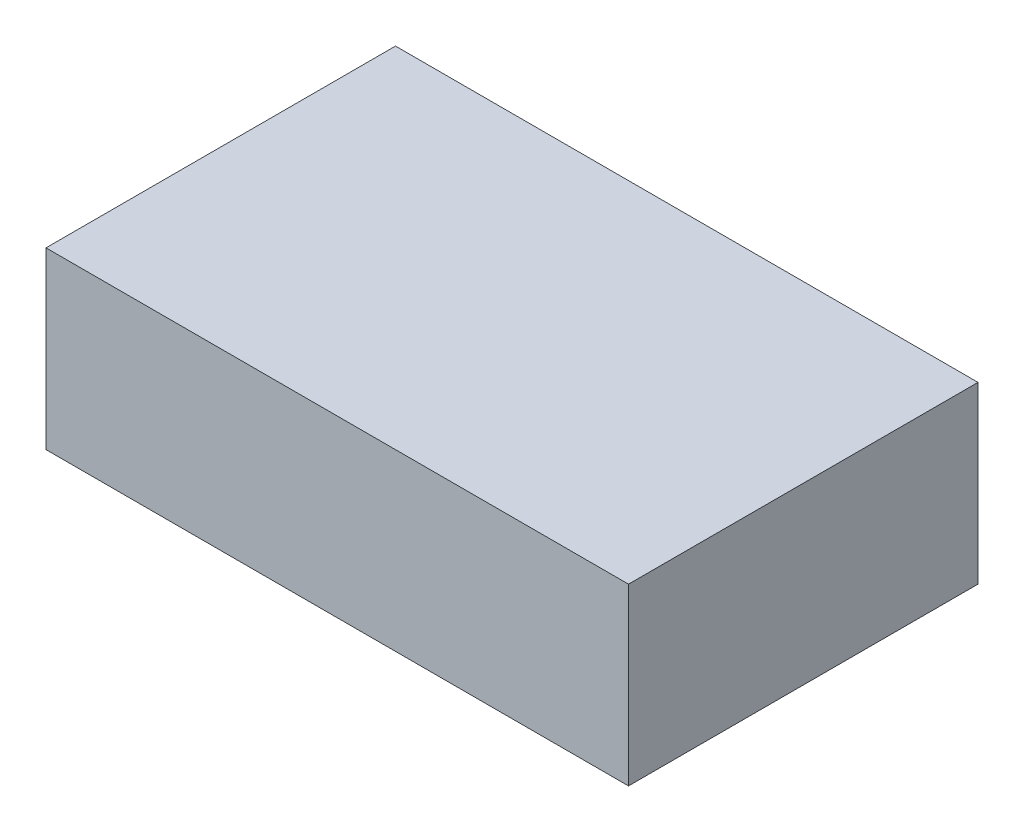
ISO-10303-21;
HEADER;
FILE_DESCRIPTION(('STEP AP214'),'2;1');
FILE_NAME('part.step','',(''),(''),'','','');
FILE_SCHEMA(('AUTOMOTIVE_DESIGN { 1 0 10303 214 1 1 1 1 }'));
ENDSEC;
DATA;
#1=APPLICATION_CONTEXT('core data for automotive mechanical design processes');
#2=APPLICATION_PROTOCOL_DEFINITION('international standard','automotive_design',2000,#1);
#3=PRODUCT_CONTEXT('',#1,'mechanical');
#4=PRODUCT('Part','Part','',(#3));
#5=PRODUCT_RELATED_PRODUCT_CATEGORY('part','',(#4));
#6=PRODUCT_DEFINITION_FORMATION('','',#4);
#7=PRODUCT_DEFINITION_CONTEXT('part definition',#1,'design');
#8=PRODUCT_DEFINITION('design','',#6,#7);
#9=PRODUCT_DEFINITION_SHAPE('','',#8);
#10=(LENGTH_UNIT() NAMED_UNIT(*) SI_UNIT(.MILLI.,.METRE.));
#11=(NAMED_UNIT(*) PLANE_ANGLE_UNIT() SI_UNIT($,.RADIAN.));
#12=(NAMED_UNIT(*) SI_UNIT($,.STERADIAN.) SOLID_ANGLE_UNIT());
#13=UNCERTAINTY_MEASURE_WITH_UNIT(LENGTH_MEASURE(1.E-05),#10,'distance_accuracy_value','');
#14=(GEOMETRIC_REPRESENTATION_CONTEXT(3) GLOBAL_UNCERTAINTY_ASSIGNED_CONTEXT((#13)) GLOBAL_UNIT_ASSIGNED_CONTEXT((#10,
#11,#12)) REPRESENTATION_CONTEXT('',''));
#15=CARTESIAN_POINT('',(0.,0.,0.));
#16=DIRECTION('',(0.,0.,1.));
#17=DIRECTION('',(1.,0.,0.));
#18=AXIS2_PLACEMENT_3D('',#15,#16,#17);
#19=CARTESIAN_POINT('',(0.,19.05,0.));
#20=DIRECTION('',(-1.,0.,0.));
#21=DIRECTION('',(0.,0.,1.));
#22=AXIS2_PLACEMENT_3D('',#19,#20,#21);
#23=PLANE('',#22);
#24=DIRECTION('',(0.,0.,-1.));
#25=VECTOR('',#24,1.);
#26=CARTESIAN_POINT('',(0.,0.,0.));
#27=LINE('',#26,#25);
#28=CARTESIAN_POINT('',(0.,0.,0.));
#29=VERTEX_POINT('',#28);
#30=CARTESIAN_POINT('',(0.,0.,-38.1));
#31=VERTEX_POINT('',#30);
#32=EDGE_CURVE('E96',#29,#31,#27,.T.);
#33=ORIENTED_EDGE('',*,*,#32,.T.);
#34=DIRECTION('',(0.,-1.,0.));
#35=VECTOR('',#34,1.);
#36=CARTESIAN_POINT('',(0.,19.05,-38.1));
#37=LINE('',#36,#35);
#38=CARTESIAN_POINT('',(0.,19.05,-38.1));
#39=VERTEX_POINT('',#38);
#40=EDGE_CURVE('E11',#39,#31,#37,.T.);
#41=ORIENTED_EDGE('',*,*,#40,.F.);
#42=DIRECTION('',(0.,0.,-1.));
#43=VECTOR('',#42,1.);
#44=CARTESIAN_POINT('',(0.,19.05,0.));
#45=LINE('',#44,#43);
#46=CARTESIAN_POINT('',(0.,19.05,0.));
#47=VERTEX_POINT('',#46);
#48=EDGE_CURVE('E84',#47,#39,#45,.T.);
#49=ORIENTED_EDGE('',*,*,#48,.F.);
#50=DIRECTION('',(0.,-1.,0.));
#51=VECTOR('',#50,1.);
#52=CARTESIAN_POINT('',(0.,19.05,0.));
#53=LINE('',#52,#51);
#54=EDGE_CURVE('E92',#47,#29,#53,.T.);
#55=ORIENTED_EDGE('',*,*,#54,.T.);
#56=EDGE_LOOP('',(#33,#41,#49,#55));
#57=FACE_BOUND('',#56,.T.);
#58=ADVANCED_FACE('F33',(#57),#23,.F.);
#59=CARTESIAN_POINT('',(0.,19.05,-38.1));
#60=DIRECTION('',(0.,0.,1.));
#61=DIRECTION('',(1.,0.,0.));
#62=AXIS2_PLACEMENT_3D('',#59,#60,#61);
#63=PLANE('',#62);
#64=DIRECTION('',(-1.,0.,0.));
#65=VECTOR('',#64,1.);
#66=CARTESIAN_POINT('',(0.,0.,-38.1));
#67=LINE('',#66,#65);
#68=CARTESIAN_POINT('',(-63.5,0.,-38.1));
#69=VERTEX_POINT('',#68);
#70=EDGE_CURVE('E88',#31,#69,#67,.T.);
#71=ORIENTED_EDGE('',*,*,#70,.T.);
#72=DIRECTION('',(0.,-1.,0.));
#73=VECTOR('',#72,1.);
#74=CARTESIAN_POINT('',(-63.5,19.05,-38.1));
#75=LINE('',#74,#73);
#76=CARTESIAN_POINT('',(-63.5,19.05,-38.1));
#77=VERTEX_POINT('',#76);
#78=EDGE_CURVE('E41',#77,#69,#75,.T.);
#79=ORIENTED_EDGE('',*,*,#78,.F.);
#80=DIRECTION('',(-1.,0.,0.));
#81=VECTOR('',#80,1.);
#82=CARTESIAN_POINT('',(0.,19.05,-38.1));
#83=LINE('',#82,#81);
#84=EDGE_CURVE('E79',#39,#77,#83,.T.);
#85=ORIENTED_EDGE('',*,*,#84,.F.);
#86=ORIENTED_EDGE('',*,*,#40,.T.);
#87=EDGE_LOOP('',(#71,#79,#85,#86));
#88=FACE_BOUND('',#87,.T.);
#89=ADVANCED_FACE('F87',(#88),#63,.F.);
#90=CARTESIAN_POINT('',(-63.5,19.05,0.));
#91=DIRECTION('',(1.,0.,0.));
#92=DIRECTION('',(0.,0.,-1.));
#93=AXIS2_PLACEMENT_3D('',#90,#91,#92);
#94=PLANE('',#93);
#95=DIRECTION('',(0.,0.,1.));
#96=VECTOR('',#95,1.);
#97=CARTESIAN_POINT('',(-63.5,0.,0.));
#98=LINE('',#97,#96);
#99=CARTESIAN_POINT('',(-63.5,0.,0.));
#100=VERTEX_POINT('',#99);
#101=EDGE_CURVE('E66',#69,#100,#98,.T.);
#102=ORIENTED_EDGE('',*,*,#101,.T.);
#103=DIRECTION('',(0.,-1.,0.));
#104=VECTOR('',#103,1.);
#105=CARTESIAN_POINT('',(-63.5,19.05,0.));
#106=LINE('',#105,#104);
#107=CARTESIAN_POINT('',(-63.5,19.05,0.));
#108=VERTEX_POINT('',#107);
#109=EDGE_CURVE('E89',#108,#100,#106,.T.);
#110=ORIENTED_EDGE('',*,*,#109,.F.);
#111=DIRECTION('',(0.,0.,1.));
#112=VECTOR('',#111,1.);
#113=CARTESIAN_POINT('',(-63.5,19.05,0.));
#114=LINE('',#113,#112);
#115=EDGE_CURVE('E82',#77,#108,#114,.T.);
#116=ORIENTED_EDGE('',*,*,#115,.F.);
#117=ORIENTED_EDGE('',*,*,#78,.T.);
#118=EDGE_LOOP('',(#102,#110,#116,#117));
#119=FACE_BOUND('',#118,.T.);
#120=ADVANCED_FACE('F90',(#119),#94,.F.);
#121=CARTESIAN_POINT('',(0.,19.05,0.));
#122=DIRECTION('',(0.,0.,-1.));
#123=DIRECTION('',(-1.,0.,0.));
#124=AXIS2_PLACEMENT_3D('',#121,#122,#123);
#125=PLANE('',#124);
#126=DIRECTION('',(1.,0.,0.));
#127=VECTOR('',#126,1.);
#128=CARTESIAN_POINT('',(0.,0.,0.));
#129=LINE('',#128,#127);
#130=EDGE_CURVE('E72',#100,#29,#129,.T.);
#131=ORIENTED_EDGE('',*,*,#130,.T.);
#132=ORIENTED_EDGE('',*,*,#54,.F.);
#133=DIRECTION('',(1.,0.,0.));
#134=VECTOR('',#133,1.);
#135=CARTESIAN_POINT('',(0.,19.05,0.));
#136=LINE('',#135,#134);
#137=EDGE_CURVE('E49',#108,#47,#136,.T.);
#138=ORIENTED_EDGE('',*,*,#137,.F.);
#139=ORIENTED_EDGE('',*,*,#109,.T.);
#140=EDGE_LOOP('',(#131,#132,#138,#139));
#141=FACE_BOUND('',#140,.T.);
#142=ADVANCED_FACE('F103',(#141),#125,.F.);
#143=CARTESIAN_POINT('',(0.,19.05,0.));
#144=DIRECTION('',(0.,1.,0.));
#145=DIRECTION('',(0.,0.,1.));
#146=AXIS2_PLACEMENT_3D('',#143,#144,#145);
#147=PLANE('',#146);
#148=ORIENTED_EDGE('',*,*,#48,.T.);
#149=ORIENTED_EDGE('',*,*,#84,.T.);
#150=ORIENTED_EDGE('',*,*,#115,.T.);
#151=ORIENTED_EDGE('',*,*,#137,.T.);
#152=EDGE_LOOP('',(#148,#149,#150,#151));
#153=FACE_BOUND('',#152,.T.);
#154=ADVANCED_FACE('F80',(#153),#147,.T.);
#155=CARTESIAN_POINT('',(0.,0.,0.));
#156=DIRECTION('',(0.,1.,0.));
#157=DIRECTION('',(0.,0.,1.));
#158=AXIS2_PLACEMENT_3D('',#155,#156,#157);
#159=PLANE('',#158);
#160=ORIENTED_EDGE('',*,*,#32,.F.);
#161=ORIENTED_EDGE('',*,*,#130,.F.);
#162=ORIENTED_EDGE('',*,*,#101,.F.);
#163=ORIENTED_EDGE('',*,*,#70,.F.);
#164=EDGE_LOOP('',(#160,#161,#162,#163));
#165=FACE_BOUND('',#164,.T.);
#166=ADVANCED_FACE('F106',(#165),#159,.F.);
#167=CLOSED_SHELL('',(#58,#89,#120,#142,#154,#166));
#168=MANIFOLD_SOLID_BREP('B2',#167);
#169=ADVANCED_BREP_SHAPE_REPRESENTATION('',(#18,#168),#14);
#170=SHAPE_DEFINITION_REPRESENTATION(#9,#169);
ENDSEC;
END-ISO-10303-21;
